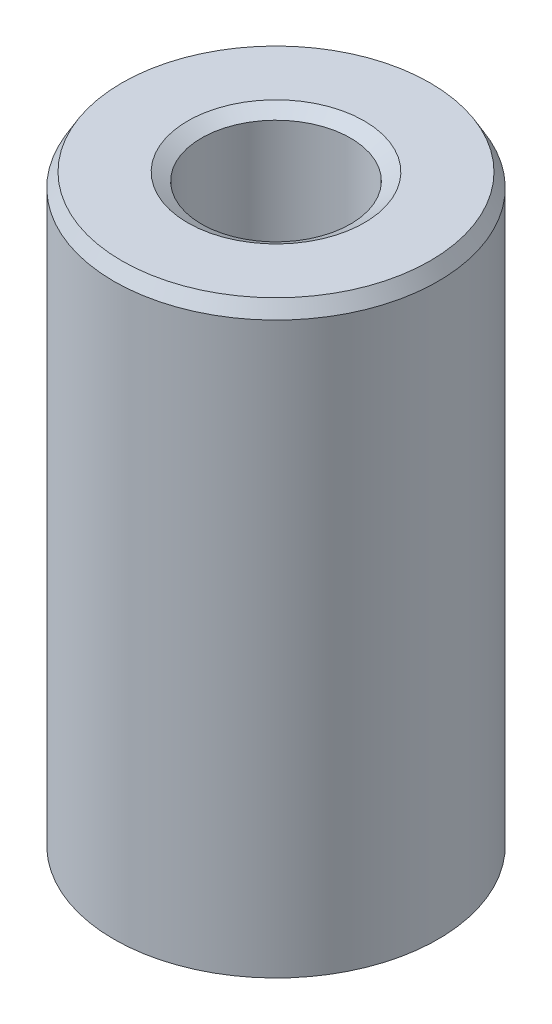
ISO-10303-21;
HEADER;
FILE_DESCRIPTION(('STEP AP214'),'2;1');
FILE_NAME('part.step','',(''),(''),'','','');
FILE_SCHEMA(('AUTOMOTIVE_DESIGN { 1 0 10303 214 1 1 1 1 }'));
ENDSEC;
DATA;
#1=APPLICATION_CONTEXT('core data for automotive mechanical design processes');
#2=APPLICATION_PROTOCOL_DEFINITION('international standard','automotive_design',2000,#1);
#3=PRODUCT_CONTEXT('',#1,'mechanical');
#4=PRODUCT('Part','Part','',(#3));
#5=PRODUCT_RELATED_PRODUCT_CATEGORY('part','',(#4));
#6=PRODUCT_DEFINITION_FORMATION('','',#4);
#7=PRODUCT_DEFINITION_CONTEXT('part definition',#1,'design');
#8=PRODUCT_DEFINITION('design','',#6,#7);
#9=PRODUCT_DEFINITION_SHAPE('','',#8);
#10=(LENGTH_UNIT() NAMED_UNIT(*) SI_UNIT(.MILLI.,.METRE.));
#11=(NAMED_UNIT(*) PLANE_ANGLE_UNIT() SI_UNIT($,.RADIAN.));
#12=(NAMED_UNIT(*) SI_UNIT($,.STERADIAN.) SOLID_ANGLE_UNIT());
#13=UNCERTAINTY_MEASURE_WITH_UNIT(LENGTH_MEASURE(1.E-05),#10,'distance_accuracy_value','');
#14=(GEOMETRIC_REPRESENTATION_CONTEXT(3) GLOBAL_UNCERTAINTY_ASSIGNED_CONTEXT((#13)) GLOBAL_UNIT_ASSIGNED_CONTEXT((#10,
#11,#12)) REPRESENTATION_CONTEXT('',''));
#15=CARTESIAN_POINT('',(0.,0.,0.));
#16=DIRECTION('',(0.,0.,1.));
#17=DIRECTION('',(1.,0.,0.));
#18=AXIS2_PLACEMENT_3D('',#15,#16,#17);
#19=CARTESIAN_POINT('',(0.,127.703927826464,0.));
#20=DIRECTION('',(0.,-1.,0.));
#21=DIRECTION('',(0.,0.,-1.));
#22=AXIS2_PLACEMENT_3D('',#19,#20,#21);
#23=CYLINDRICAL_SURFACE('',#22,35.);
#24=CARTESIAN_POINT('',(0.,1.71525501134434,0.));
#25=DIRECTION('',(0.,1.,0.));
#26=DIRECTION('',(0.,0.,1.));
#27=AXIS2_PLACEMENT_3D('',#24,#25,#26);
#28=CIRCLE('',#27,35.);
#29=CARTESIAN_POINT('',(0.,1.71525501134434,35.));
#30=VERTEX_POINT('',#29);
#31=EDGE_CURVE('E10',#30,#30,#28,.T.);
#32=ORIENTED_EDGE('',*,*,#31,.T.);
#33=EDGE_LOOP('',(#32));
#34=FACE_BOUND('',#33,.T.);
#35=CARTESIAN_POINT('',(0.,124.733018998878,0.));
#36=DIRECTION('',(0.,1.,0.));
#37=DIRECTION('',(0.,0.,1.));
#38=AXIS2_PLACEMENT_3D('',#35,#36,#37);
#39=CIRCLE('',#38,35.);
#40=CARTESIAN_POINT('',(0.,124.733018998878,35.));
#41=VERTEX_POINT('',#40);
#42=EDGE_CURVE('E50',#41,#41,#39,.F.);
#43=ORIENTED_EDGE('',*,*,#42,.T.);
#44=EDGE_LOOP('',(#43));
#45=FACE_BOUND('',#44,.T.);
#46=ADVANCED_FACE('F39',(#34,#45),#23,.T.);
#47=CARTESIAN_POINT('',(0.,127.703927826464,0.));
#48=DIRECTION('',(0.,1.,0.));
#49=DIRECTION('',(0.,0.,1.));
#50=AXIS2_PLACEMENT_3D('',#47,#48,#49);
#51=PLANE('',#50);
#52=CARTESIAN_POINT('',(0.,127.703927826464,0.));
#53=DIRECTION('',(0.,1.,0.));
#54=DIRECTION('',(0.,0.,1.));
#55=AXIS2_PLACEMENT_3D('',#52,#53,#54);
#56=CIRCLE('',#55,19.0650309232801);
#57=CARTESIAN_POINT('',(0.,127.703927826464,19.0650309232801));
#58=VERTEX_POINT('',#57);
#59=EDGE_CURVE('E58',#58,#58,#56,.F.);
#60=ORIENTED_EDGE('',*,*,#59,.T.);
#61=EDGE_LOOP('',(#60));
#62=FACE_BOUND('',#61,.T.);
#63=CARTESIAN_POINT('',(0.,127.703927826464,0.));
#64=DIRECTION('',(0.,1.,0.));
#65=DIRECTION('',(0.,0.,1.));
#66=AXIS2_PLACEMENT_3D('',#63,#64,#65);
#67=CIRCLE('',#66,33.2847449886556);
#68=CARTESIAN_POINT('',(0.,127.703927826464,33.2847449886556));
#69=VERTEX_POINT('',#68);
#70=EDGE_CURVE('E61',#69,#69,#67,.T.);
#71=ORIENTED_EDGE('',*,*,#70,.T.);
#72=EDGE_LOOP('',(#71));
#73=FACE_BOUND('',#72,.T.);
#74=ADVANCED_FACE('F88',(#62,#73),#51,.T.);
#75=CARTESIAN_POINT('',(0.,0.,0.));
#76=DIRECTION('',(0.,1.,0.));
#77=DIRECTION('',(0.,0.,1.));
#78=AXIS2_PLACEMENT_3D('',#75,#76,#77);
#79=PLANE('',#78);
#80=CARTESIAN_POINT('',(0.,0.,0.));
#81=DIRECTION('',(0.,1.,0.));
#82=DIRECTION('',(0.,0.,1.));
#83=AXIS2_PLACEMENT_3D('',#80,#81,#82);
#84=CIRCLE('',#83,17.8093771070389);
#85=CARTESIAN_POINT('',(0.,0.,17.8093771070389));
#86=VERTEX_POINT('',#85);
#87=EDGE_CURVE('E51',#86,#86,#84,.T.);
#88=ORIENTED_EDGE('',*,*,#87,.T.);
#89=EDGE_LOOP('',(#88));
#90=FACE_BOUND('',#89,.T.);
#91=CARTESIAN_POINT('',(0.,0.,0.));
#92=DIRECTION('',(0.,1.,0.));
#93=DIRECTION('',(0.,0.,1.));
#94=AXIS2_PLACEMENT_3D('',#91,#92,#93);
#95=CIRCLE('',#94,32.0290911724145);
#96=CARTESIAN_POINT('',(0.,0.,32.0290911724145));
#97=VERTEX_POINT('',#96);
#98=EDGE_CURVE('E54',#97,#97,#95,.F.);
#99=ORIENTED_EDGE('',*,*,#98,.T.);
#100=EDGE_LOOP('',(#99));
#101=FACE_BOUND('',#100,.T.);
#102=ADVANCED_FACE('F83',(#90,#101),#79,.F.);
#103=CARTESIAN_POINT('',(0.,127.703927826464,0.));
#104=DIRECTION('',(0.,-1.,0.));
#105=DIRECTION('',(0.,0.,-1.));
#106=AXIS2_PLACEMENT_3D('',#103,#104,#105);
#107=CYLINDRICAL_SURFACE('',#106,16.0941220956945);
#108=CARTESIAN_POINT('',(0.,125.98867281512,0.));
#109=DIRECTION('',(0.,1.,0.));
#110=DIRECTION('',(0.,0.,1.));
#111=AXIS2_PLACEMENT_3D('',#108,#109,#110);
#112=CIRCLE('',#111,16.0941220956945);
#113=CARTESIAN_POINT('',(0.,125.98867281512,16.0941220956945));
#114=VERTEX_POINT('',#113);
#115=EDGE_CURVE('E67',#114,#114,#112,.T.);
#116=ORIENTED_EDGE('',*,*,#115,.T.);
#117=EDGE_LOOP('',(#116));
#118=FACE_BOUND('',#117,.T.);
#119=CARTESIAN_POINT('',(0.,2.97090882758558,0.));
#120=DIRECTION('',(0.,1.,0.));
#121=DIRECTION('',(0.,0.,1.));
#122=AXIS2_PLACEMENT_3D('',#119,#120,#121);
#123=CIRCLE('',#122,16.0941220956945);
#124=CARTESIAN_POINT('',(0.,2.97090882758558,16.0941220956945));
#125=VERTEX_POINT('',#124);
#126=EDGE_CURVE('E69',#125,#125,#123,.F.);
#127=ORIENTED_EDGE('',*,*,#126,.T.);
#128=EDGE_LOOP('',(#127));
#129=FACE_BOUND('',#128,.T.);
#130=ADVANCED_FACE('F71',(#118,#129),#107,.F.);
#131=CARTESIAN_POINT('',(0.,125.98867281512,0.));
#132=DIRECTION('',(0.,1.,0.));
#133=DIRECTION('',(0.,0.,1.));
#134=AXIS2_PLACEMENT_3D('',#131,#132,#133);
#135=CONICAL_SURFACE('',#134,16.0941220956945,1.0471975511966);
#136=ORIENTED_EDGE('',*,*,#59,.F.);
#137=EDGE_LOOP('',(#136));
#138=FACE_BOUND('',#137,.T.);
#139=ORIENTED_EDGE('',*,*,#115,.F.);
#140=EDGE_LOOP('',(#139));
#141=FACE_BOUND('',#140,.T.);
#142=ADVANCED_FACE('F77',(#138,#141),#135,.F.);
#143=CARTESIAN_POINT('',(0.,0.,0.));
#144=DIRECTION('',(0.,-1.,0.));
#145=DIRECTION('',(0.,0.,-1.));
#146=AXIS2_PLACEMENT_3D('',#143,#144,#145);
#147=CONICAL_SURFACE('',#146,17.8093771070389,0.523598775598294);
#148=ORIENTED_EDGE('',*,*,#126,.F.);
#149=EDGE_LOOP('',(#148));
#150=FACE_BOUND('',#149,.T.);
#151=ORIENTED_EDGE('',*,*,#87,.F.);
#152=EDGE_LOOP('',(#151));
#153=FACE_BOUND('',#152,.T.);
#154=ADVANCED_FACE('F73',(#150,#153),#147,.F.);
#155=CARTESIAN_POINT('',(0.,1.71525501134434,0.));
#156=DIRECTION('',(0.,1.,0.));
#157=DIRECTION('',(0.,0.,1.));
#158=AXIS2_PLACEMENT_3D('',#155,#156,#157);
#159=CONICAL_SURFACE('',#158,35.,1.0471975511966);
#160=ORIENTED_EDGE('',*,*,#98,.F.);
#161=EDGE_LOOP('',(#160));
#162=FACE_BOUND('',#161,.T.);
#163=ORIENTED_EDGE('',*,*,#31,.F.);
#164=EDGE_LOOP('',(#163));
#165=FACE_BOUND('',#164,.T.);
#166=ADVANCED_FACE('F76',(#162,#165),#159,.T.);
#167=CARTESIAN_POINT('',(0.,127.703927826464,0.));
#168=DIRECTION('',(0.,-1.,0.));
#169=DIRECTION('',(0.,0.,-1.));
#170=AXIS2_PLACEMENT_3D('',#167,#168,#169);
#171=CONICAL_SURFACE('',#170,33.2847449886556,0.523598775598303);
#172=ORIENTED_EDGE('',*,*,#42,.F.);
#173=EDGE_LOOP('',(#172));
#174=FACE_BOUND('',#173,.T.);
#175=ORIENTED_EDGE('',*,*,#70,.F.);
#176=EDGE_LOOP('',(#175));
#177=FACE_BOUND('',#176,.T.);
#178=ADVANCED_FACE('F45',(#174,#177),#171,.T.);
#179=CLOSED_SHELL('',(#46,#74,#102,#130,#142,#154,#166,#178));
#180=MANIFOLD_SOLID_BREP('B2',#179);
#181=ADVANCED_BREP_SHAPE_REPRESENTATION('',(#18,#180),#14);
#182=SHAPE_DEFINITION_REPRESENTATION(#9,#181);
ENDSEC;
END-ISO-10303-21;
